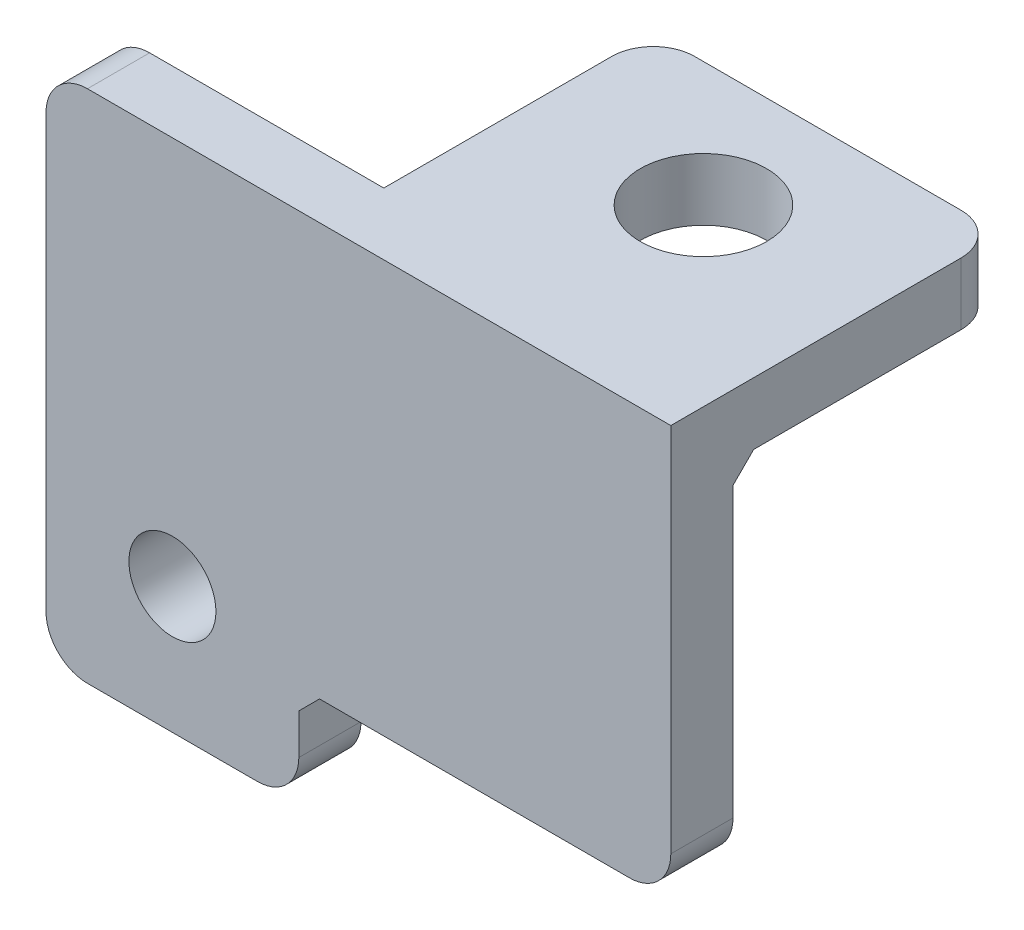
ISO-10303-21;
HEADER;
FILE_DESCRIPTION(('STEP AP214'),'2;1');
FILE_NAME('part.step','',(''),(''),'','','');
FILE_SCHEMA(('AUTOMOTIVE_DESIGN { 1 0 10303 214 1 1 1 1 }'));
ENDSEC;
DATA;
#1=APPLICATION_CONTEXT('core data for automotive mechanical design processes');
#2=APPLICATION_PROTOCOL_DEFINITION('international standard','automotive_design',2000,#1);
#3=PRODUCT_CONTEXT('',#1,'mechanical');
#4=PRODUCT('Part','Part','',(#3));
#5=PRODUCT_RELATED_PRODUCT_CATEGORY('part','',(#4));
#6=PRODUCT_DEFINITION_FORMATION('','',#4);
#7=PRODUCT_DEFINITION_CONTEXT('part definition',#1,'design');
#8=PRODUCT_DEFINITION('design','',#6,#7);
#9=PRODUCT_DEFINITION_SHAPE('','',#8);
#10=(LENGTH_UNIT() NAMED_UNIT(*) SI_UNIT(.MILLI.,.METRE.));
#11=(NAMED_UNIT(*) PLANE_ANGLE_UNIT() SI_UNIT($,.RADIAN.));
#12=(NAMED_UNIT(*) SI_UNIT($,.STERADIAN.) SOLID_ANGLE_UNIT());
#13=UNCERTAINTY_MEASURE_WITH_UNIT(LENGTH_MEASURE(1.E-05),#10,'distance_accuracy_value','');
#14=(GEOMETRIC_REPRESENTATION_CONTEXT(3) GLOBAL_UNCERTAINTY_ASSIGNED_CONTEXT((#13)) GLOBAL_UNIT_ASSIGNED_CONTEXT((#10,
#11,#12)) REPRESENTATION_CONTEXT('',''));
#15=CARTESIAN_POINT('',(0.,0.,0.));
#16=DIRECTION('',(0.,0.,1.));
#17=DIRECTION('',(1.,0.,0.));
#18=AXIS2_PLACEMENT_3D('',#15,#16,#17);
#19=CARTESIAN_POINT('',(0.,0.,0.));
#20=DIRECTION('',(0.,0.,1.));
#21=DIRECTION('',(1.,0.,0.));
#22=AXIS2_PLACEMENT_3D('',#19,#20,#21);
#23=PLANE('',#22);
#24=CARTESIAN_POINT('',(0.900000000000694,59.,0.));
#25=DIRECTION('',(0.,0.,1.));
#26=DIRECTION('',(1.,0.,0.));
#27=AXIS2_PLACEMENT_3D('',#24,#25,#26);
#28=CIRCLE('',#27,2.1);
#29=CARTESIAN_POINT('',(3.00000000000069,59.,0.));
#30=VERTEX_POINT('',#29);
#31=EDGE_CURVE('E248',#30,#30,#28,.T.);
#32=ORIENTED_EDGE('',*,*,#31,.T.);
#33=EDGE_LOOP('',(#32));
#34=FACE_BOUND('',#33,.T.);
#35=DIRECTION('',(0.,-1.,0.));
#36=VECTOR('',#35,1.);
#37=CARTESIAN_POINT('',(-5.19999999999931,77.7499999999997,0.));
#38=LINE('',#37,#36);
#39=CARTESIAN_POINT('',(-5.19999999999931,75.7499999999997,0.));
#40=VERTEX_POINT('',#39);
#41=CARTESIAN_POINT('',(-5.1999999999993,54.9,0.));
#42=VERTEX_POINT('',#41);
#43=EDGE_CURVE('E253',#40,#42,#38,.T.);
#44=ORIENTED_EDGE('',*,*,#43,.F.);
#45=CARTESIAN_POINT('',(-3.19999999999931,75.7499999999997,0.));
#46=DIRECTION('',(0.,0.,1.));
#47=DIRECTION('',(1.,0.,0.));
#48=AXIS2_PLACEMENT_3D('',#45,#46,#47);
#49=CIRCLE('',#48,2.);
#50=CARTESIAN_POINT('',(-3.19999999999931,77.7499999999997,0.));
#51=VERTEX_POINT('',#50);
#52=EDGE_CURVE('E364',#40,#51,#49,.F.);
#53=ORIENTED_EDGE('',*,*,#52,.T.);
#54=DIRECTION('',(-1.,0.,0.));
#55=VECTOR('',#54,1.);
#56=CARTESIAN_POINT('',(-5.19999999999931,77.7499999999997,0.));
#57=LINE('',#56,#55);
#58=CARTESIAN_POINT('',(8.1000000000007,77.7499999999997,0.));
#59=VERTEX_POINT('',#58);
#60=EDGE_CURVE('E262',#59,#51,#57,.T.);
#61=ORIENTED_EDGE('',*,*,#60,.F.);
#62=DIRECTION('',(0.,1.,0.));
#63=VECTOR('',#62,1.);
#64=CARTESIAN_POINT('',(8.1000000000007,0.,0.));
#65=LINE('',#64,#63);
#66=CARTESIAN_POINT('',(8.1000000000007,73.7499999999997,0.));
#67=VERTEX_POINT('',#66);
#68=EDGE_CURVE('E241',#67,#59,#65,.T.);
#69=ORIENTED_EDGE('',*,*,#68,.F.);
#70=DIRECTION('',(1.,0.,0.));
#71=VECTOR('',#70,1.);
#72=CARTESIAN_POINT('',(0.,73.7499999999997,0.));
#73=LINE('',#72,#71);
#74=CARTESIAN_POINT('',(24.9500000000057,73.7499999999997,0.));
#75=VERTEX_POINT('',#74);
#76=EDGE_CURVE('E308',#67,#75,#73,.T.);
#77=ORIENTED_EDGE('',*,*,#76,.T.);
#78=DIRECTION('',(0.,1.,0.));
#79=VECTOR('',#78,1.);
#80=CARTESIAN_POINT('',(24.9500000000057,57.8499999999997,0.));
#81=LINE('',#80,#79);
#82=CARTESIAN_POINT('',(24.9500000000057,59.8499999999997,0.));
#83=VERTEX_POINT('',#82);
#84=EDGE_CURVE('E295',#83,#75,#81,.T.);
#85=ORIENTED_EDGE('',*,*,#84,.F.);
#86=CARTESIAN_POINT('',(22.9500000000057,59.8499999999997,0.));
#87=DIRECTION('',(0.,0.,1.));
#88=DIRECTION('',(1.,0.,0.));
#89=AXIS2_PLACEMENT_3D('',#86,#87,#88);
#90=CIRCLE('',#89,2.);
#91=CARTESIAN_POINT('',(22.9500000000057,57.8499999999997,0.));
#92=VERTEX_POINT('',#91);
#93=EDGE_CURVE('E355',#83,#92,#90,.F.);
#94=ORIENTED_EDGE('',*,*,#93,.T.);
#95=DIRECTION('',(1.,0.,0.));
#96=VECTOR('',#95,1.);
#97=CARTESIAN_POINT('',(7.00000000000069,57.8499999999997,0.));
#98=LINE('',#97,#96);
#99=CARTESIAN_POINT('',(21.9500000000057,57.8499999999997,0.));
#100=VERTEX_POINT('',#99);
#101=EDGE_CURVE('E291',#100,#92,#98,.T.);
#102=ORIENTED_EDGE('',*,*,#101,.F.);
#103=DIRECTION('',(0.,-1.,0.));
#104=VECTOR('',#103,1.);
#105=CARTESIAN_POINT('',(21.9500000000057,57.8499999999997,0.));
#106=LINE('',#105,#104);
#107=CARTESIAN_POINT('',(21.9500000000057,59.8499999999997,0.));
#108=VERTEX_POINT('',#107);
#109=EDGE_CURVE('E221',#108,#100,#106,.T.);
#110=ORIENTED_EDGE('',*,*,#109,.F.);
#111=DIRECTION('',(-1.,0.,0.));
#112=VECTOR('',#111,1.);
#113=CARTESIAN_POINT('',(16.4000000000057,59.8499999999997,0.));
#114=LINE('',#113,#112);
#115=CARTESIAN_POINT('',(16.4000000000057,59.8499999999997,0.));
#116=VERTEX_POINT('',#115);
#117=EDGE_CURVE('E312',#108,#116,#114,.T.);
#118=ORIENTED_EDGE('',*,*,#117,.T.);
#119=DIRECTION('',(0.,1.,0.));
#120=VECTOR('',#119,1.);
#121=CARTESIAN_POINT('',(16.4000000000057,57.8499999999997,0.));
#122=LINE('',#121,#120);
#123=CARTESIAN_POINT('',(16.4000000000057,57.8499999999997,0.));
#124=VERTEX_POINT('',#123);
#125=EDGE_CURVE('E217',#124,#116,#122,.T.);
#126=ORIENTED_EDGE('',*,*,#125,.F.);
#127=CARTESIAN_POINT('',(8.00000000000071,57.8499999999997,0.));
#128=VERTEX_POINT('',#127);
#129=EDGE_CURVE('E292',#128,#124,#98,.T.);
#130=ORIENTED_EDGE('',*,*,#129,.F.);
#131=DIRECTION('',(0.707106781186551,0.707106781186544,0.));
#132=VECTOR('',#131,1.);
#133=CARTESIAN_POINT('',(-24.9249999999995,24.9249999999998,0.));
#134=LINE('',#133,#132);
#135=CARTESIAN_POINT('',(7.00000000000069,56.8499999999997,0.));
#136=VERTEX_POINT('',#135);
#137=EDGE_CURVE('E333',#128,#136,#134,.F.);
#138=ORIENTED_EDGE('',*,*,#137,.T.);
#139=DIRECTION('',(0.,1.,0.));
#140=VECTOR('',#139,1.);
#141=CARTESIAN_POINT('',(7.00000000000069,57.8499999999997,0.));
#142=LINE('',#141,#140);
#143=CARTESIAN_POINT('',(7.00000000000069,54.9,0.));
#144=VERTEX_POINT('',#143);
#145=EDGE_CURVE('E288',#144,#136,#142,.T.);
#146=ORIENTED_EDGE('',*,*,#145,.F.);
#147=CARTESIAN_POINT('',(5.00000000000069,54.9,0.));
#148=DIRECTION('',(0.,0.,1.));
#149=DIRECTION('',(1.,0.,0.));
#150=AXIS2_PLACEMENT_3D('',#147,#148,#149);
#151=CIRCLE('',#150,2.);
#152=CARTESIAN_POINT('',(5.00000000000069,52.9,0.));
#153=VERTEX_POINT('',#152);
#154=EDGE_CURVE('E358',#144,#153,#151,.F.);
#155=ORIENTED_EDGE('',*,*,#154,.T.);
#156=DIRECTION('',(1.,0.,0.));
#157=VECTOR('',#156,1.);
#158=CARTESIAN_POINT('',(-5.1999999999993,52.9,0.));
#159=LINE('',#158,#157);
#160=CARTESIAN_POINT('',(-3.1999999999993,52.9,0.));
#161=VERTEX_POINT('',#160);
#162=EDGE_CURVE('E284',#161,#153,#159,.T.);
#163=ORIENTED_EDGE('',*,*,#162,.F.);
#164=CARTESIAN_POINT('',(-3.1999999999993,54.9,0.));
#165=DIRECTION('',(0.,0.,1.));
#166=DIRECTION('',(1.,0.,0.));
#167=AXIS2_PLACEMENT_3D('',#164,#165,#166);
#168=CIRCLE('',#167,2.);
#169=EDGE_CURVE('E361',#161,#42,#168,.F.);
#170=ORIENTED_EDGE('',*,*,#169,.T.);
#171=EDGE_LOOP('',(#44,#53,#61,#69,#77,#85,#94,#102,#110,#118,#126,#130,#138,#146,#155,#163,#170));
#172=FACE_BOUND('',#171,.T.);
#173=ADVANCED_FACE('F41',(#34,#172),#23,.F.);
#174=CARTESIAN_POINT('',(0.,0.,3.));
#175=DIRECTION('',(0.,0.,1.));
#176=DIRECTION('',(1.,0.,0.));
#177=AXIS2_PLACEMENT_3D('',#174,#175,#176);
#178=PLANE('',#177);
#179=DIRECTION('',(-1.,0.,0.));
#180=VECTOR('',#179,1.);
#181=CARTESIAN_POINT('',(24.9500000000057,77.7499999999997,3.));
#182=LINE('',#181,#180);
#183=CARTESIAN_POINT('',(24.9500000000057,77.7499999999997,3.));
#184=VERTEX_POINT('',#183);
#185=CARTESIAN_POINT('',(-3.19999999999931,77.7499999999997,3.));
#186=VERTEX_POINT('',#185);
#187=EDGE_CURVE('E276',#184,#186,#182,.T.);
#188=ORIENTED_EDGE('',*,*,#187,.T.);
#189=CARTESIAN_POINT('',(-3.19999999999931,75.7499999999997,3.));
#190=DIRECTION('',(0.,0.,1.));
#191=DIRECTION('',(1.,0.,0.));
#192=AXIS2_PLACEMENT_3D('',#189,#190,#191);
#193=CIRCLE('',#192,2.);
#194=CARTESIAN_POINT('',(-5.19999999999931,75.7499999999997,3.));
#195=VERTEX_POINT('',#194);
#196=EDGE_CURVE('E385',#186,#195,#193,.T.);
#197=ORIENTED_EDGE('',*,*,#196,.T.);
#198=DIRECTION('',(0.,-1.,0.));
#199=VECTOR('',#198,1.);
#200=CARTESIAN_POINT('',(-5.19999999999931,77.7499999999997,3.));
#201=LINE('',#200,#199);
#202=CARTESIAN_POINT('',(-5.1999999999993,54.9,3.));
#203=VERTEX_POINT('',#202);
#204=EDGE_CURVE('E257',#195,#203,#201,.T.);
#205=ORIENTED_EDGE('',*,*,#204,.T.);
#206=CARTESIAN_POINT('',(-3.1999999999993,54.9,3.));
#207=DIRECTION('',(0.,0.,1.));
#208=DIRECTION('',(1.,0.,0.));
#209=AXIS2_PLACEMENT_3D('',#206,#207,#208);
#210=CIRCLE('',#209,2.);
#211=CARTESIAN_POINT('',(-3.1999999999993,52.9,3.));
#212=VERTEX_POINT('',#211);
#213=EDGE_CURVE('E382',#203,#212,#210,.T.);
#214=ORIENTED_EDGE('',*,*,#213,.T.);
#215=DIRECTION('',(1.,0.,0.));
#216=VECTOR('',#215,1.);
#217=CARTESIAN_POINT('',(-5.1999999999993,52.9,3.));
#218=LINE('',#217,#216);
#219=CARTESIAN_POINT('',(5.00000000000069,52.9,3.));
#220=VERTEX_POINT('',#219);
#221=EDGE_CURVE('E261',#212,#220,#218,.T.);
#222=ORIENTED_EDGE('',*,*,#221,.T.);
#223=CARTESIAN_POINT('',(5.00000000000069,54.9,3.));
#224=DIRECTION('',(0.,0.,1.));
#225=DIRECTION('',(1.,0.,0.));
#226=AXIS2_PLACEMENT_3D('',#223,#224,#225);
#227=CIRCLE('',#226,2.);
#228=CARTESIAN_POINT('',(7.00000000000069,54.9,3.));
#229=VERTEX_POINT('',#228);
#230=EDGE_CURVE('E379',#220,#229,#227,.T.);
#231=ORIENTED_EDGE('',*,*,#230,.T.);
#232=DIRECTION('',(0.,1.,0.));
#233=VECTOR('',#232,1.);
#234=CARTESIAN_POINT('',(7.00000000000069,57.8499999999997,3.));
#235=LINE('',#234,#233);
#236=CARTESIAN_POINT('',(7.00000000000069,56.8499999999997,3.));
#237=VERTEX_POINT('',#236);
#238=EDGE_CURVE('E266',#229,#237,#235,.T.);
#239=ORIENTED_EDGE('',*,*,#238,.T.);
#240=DIRECTION('',(-0.707106781186551,-0.707106781186544,0.));
#241=VECTOR('',#240,1.);
#242=CARTESIAN_POINT('',(8.00000000000071,57.8499999999997,3.));
#243=LINE('',#242,#241);
#244=CARTESIAN_POINT('',(8.00000000000071,57.8499999999997,3.));
#245=VERTEX_POINT('',#244);
#246=EDGE_CURVE('E337',#237,#245,#243,.F.);
#247=ORIENTED_EDGE('',*,*,#246,.T.);
#248=DIRECTION('',(1.,0.,0.));
#249=VECTOR('',#248,1.);
#250=CARTESIAN_POINT('',(7.00000000000069,57.8499999999997,3.));
#251=LINE('',#250,#249);
#252=CARTESIAN_POINT('',(22.9500000000057,57.8499999999997,3.));
#253=VERTEX_POINT('',#252);
#254=EDGE_CURVE('E269',#245,#253,#251,.T.);
#255=ORIENTED_EDGE('',*,*,#254,.T.);
#256=CARTESIAN_POINT('',(22.9500000000057,59.8499999999997,3.));
#257=DIRECTION('',(0.,0.,1.));
#258=DIRECTION('',(1.,0.,0.));
#259=AXIS2_PLACEMENT_3D('',#256,#257,#258);
#260=CIRCLE('',#259,2.);
#261=CARTESIAN_POINT('',(24.9500000000057,59.8499999999997,3.));
#262=VERTEX_POINT('',#261);
#263=EDGE_CURVE('E376',#253,#262,#260,.T.);
#264=ORIENTED_EDGE('',*,*,#263,.T.);
#265=DIRECTION('',(0.,1.,0.));
#266=VECTOR('',#265,1.);
#267=CARTESIAN_POINT('',(24.9500000000057,57.8499999999997,3.));
#268=LINE('',#267,#266);
#269=EDGE_CURVE('E273',#262,#184,#268,.T.);
#270=ORIENTED_EDGE('',*,*,#269,.T.);
#271=EDGE_LOOP('',(#188,#197,#205,#214,#222,#231,#239,#247,#255,#264,#270));
#272=FACE_BOUND('',#271,.T.);
#273=CARTESIAN_POINT('',(0.900000000000694,59.,3.));
#274=DIRECTION('',(0.,0.,1.));
#275=DIRECTION('',(1.,0.,0.));
#276=AXIS2_PLACEMENT_3D('',#273,#274,#275);
#277=CIRCLE('',#276,2.1);
#278=CARTESIAN_POINT('',(3.00000000000069,59.,3.));
#279=VERTEX_POINT('',#278);
#280=EDGE_CURVE('E249',#279,#279,#277,.T.);
#281=ORIENTED_EDGE('',*,*,#280,.F.);
#282=EDGE_LOOP('',(#281));
#283=FACE_BOUND('',#282,.T.);
#284=ADVANCED_FACE('F452',(#272,#283),#178,.T.);
#285=CARTESIAN_POINT('',(-5.19999999999931,77.7499999999997,3.));
#286=DIRECTION('',(1.,0.,0.));
#287=DIRECTION('',(0.,1.,0.));
#288=AXIS2_PLACEMENT_3D('',#285,#286,#287);
#289=PLANE('',#288);
#290=ORIENTED_EDGE('',*,*,#204,.F.);
#291=DIRECTION('',(0.,0.,-1.));
#292=VECTOR('',#291,1.);
#293=CARTESIAN_POINT('',(-5.19999999999931,75.7499999999997,3.));
#294=LINE('',#293,#292);
#295=EDGE_CURVE('E351',#195,#40,#294,.T.);
#296=ORIENTED_EDGE('',*,*,#295,.T.);
#297=ORIENTED_EDGE('',*,*,#43,.T.);
#298=DIRECTION('',(0.,0.,-1.));
#299=VECTOR('',#298,1.);
#300=CARTESIAN_POINT('',(-5.1999999999993,54.9,3.));
#301=LINE('',#300,#299);
#302=EDGE_CURVE('E348',#42,#203,#301,.F.);
#303=ORIENTED_EDGE('',*,*,#302,.T.);
#304=EDGE_LOOP('',(#290,#296,#297,#303));
#305=FACE_BOUND('',#304,.T.);
#306=ADVANCED_FACE('F456',(#305),#289,.F.);
#307=CARTESIAN_POINT('',(-5.1999999999993,52.9,3.));
#308=DIRECTION('',(0.,1.,0.));
#309=DIRECTION('',(0.,0.,1.));
#310=AXIS2_PLACEMENT_3D('',#307,#308,#309);
#311=PLANE('',#310);
#312=ORIENTED_EDGE('',*,*,#221,.F.);
#313=DIRECTION('',(0.,0.,-1.));
#314=VECTOR('',#313,1.);
#315=CARTESIAN_POINT('',(-3.1999999999993,52.9,3.));
#316=LINE('',#315,#314);
#317=EDGE_CURVE('E391',#212,#161,#316,.T.);
#318=ORIENTED_EDGE('',*,*,#317,.T.);
#319=ORIENTED_EDGE('',*,*,#162,.T.);
#320=DIRECTION('',(0.,0.,-1.));
#321=VECTOR('',#320,1.);
#322=CARTESIAN_POINT('',(5.00000000000069,52.9,3.));
#323=LINE('',#322,#321);
#324=EDGE_CURVE('E388',#153,#220,#323,.F.);
#325=ORIENTED_EDGE('',*,*,#324,.T.);
#326=EDGE_LOOP('',(#312,#318,#319,#325));
#327=FACE_BOUND('',#326,.T.);
#328=ADVANCED_FACE('F464',(#327),#311,.F.);
#329=CARTESIAN_POINT('',(7.00000000000069,57.8499999999997,3.));
#330=DIRECTION('',(-1.,0.,0.));
#331=DIRECTION('',(0.,-1.,0.));
#332=AXIS2_PLACEMENT_3D('',#329,#330,#331);
#333=PLANE('',#332);
#334=ORIENTED_EDGE('',*,*,#238,.F.);
#335=DIRECTION('',(0.,0.,-1.));
#336=VECTOR('',#335,1.);
#337=CARTESIAN_POINT('',(7.00000000000069,54.9,3.));
#338=LINE('',#337,#336);
#339=EDGE_CURVE('E395',#229,#144,#338,.T.);
#340=ORIENTED_EDGE('',*,*,#339,.T.);
#341=ORIENTED_EDGE('',*,*,#145,.T.);
#342=DIRECTION('',(0.,0.,1.));
#343=VECTOR('',#342,1.);
#344=CARTESIAN_POINT('',(7.00000000000069,56.8499999999997,3.));
#345=LINE('',#344,#343);
#346=EDGE_CURVE('E320',#136,#237,#345,.T.);
#347=ORIENTED_EDGE('',*,*,#346,.T.);
#348=EDGE_LOOP('',(#334,#340,#341,#347));
#349=FACE_BOUND('',#348,.T.);
#350=ADVANCED_FACE('F472',(#349),#333,.F.);
#351=CARTESIAN_POINT('',(7.00000000000069,57.8499999999997,3.));
#352=DIRECTION('',(0.,1.,0.));
#353=DIRECTION('',(0.,0.,1.));
#354=AXIS2_PLACEMENT_3D('',#351,#352,#353);
#355=PLANE('',#354);
#356=ORIENTED_EDGE('',*,*,#101,.T.);
#357=DIRECTION('',(0.,0.,-1.));
#358=VECTOR('',#357,1.);
#359=CARTESIAN_POINT('',(22.9500000000057,57.8499999999997,3.));
#360=LINE('',#359,#358);
#361=EDGE_CURVE('E407',#92,#253,#360,.F.);
#362=ORIENTED_EDGE('',*,*,#361,.T.);
#363=ORIENTED_EDGE('',*,*,#254,.F.);
#364=DIRECTION('',(0.,0.,-1.));
#365=VECTOR('',#364,1.);
#366=CARTESIAN_POINT('',(8.00000000000071,57.8499999999997,0.));
#367=LINE('',#366,#365);
#368=EDGE_CURVE('E316',#245,#128,#367,.T.);
#369=ORIENTED_EDGE('',*,*,#368,.T.);
#370=ORIENTED_EDGE('',*,*,#129,.T.);
#371=DIRECTION('',(0.,0.,1.));
#372=VECTOR('',#371,1.);
#373=CARTESIAN_POINT('',(16.4000000000057,57.8499999999997,-3.));
#374=LINE('',#373,#372);
#375=CARTESIAN_POINT('',(16.4000000000057,57.8499999999997,-3.));
#376=VERTEX_POINT('',#375);
#377=EDGE_CURVE('E202',#376,#124,#374,.T.);
#378=ORIENTED_EDGE('',*,*,#377,.F.);
#379=DIRECTION('',(-1.,0.,0.));
#380=VECTOR('',#379,1.);
#381=CARTESIAN_POINT('',(21.9500000000057,57.8499999999997,-3.));
#382=LINE('',#381,#380);
#383=CARTESIAN_POINT('',(21.9500000000057,57.8499999999997,-3.));
#384=VERTEX_POINT('',#383);
#385=EDGE_CURVE('E194',#384,#376,#382,.T.);
#386=ORIENTED_EDGE('',*,*,#385,.F.);
#387=DIRECTION('',(0.,0.,1.));
#388=VECTOR('',#387,1.);
#389=CARTESIAN_POINT('',(21.9500000000057,57.8499999999997,-3.));
#390=LINE('',#389,#388);
#391=EDGE_CURVE('E199',#384,#100,#390,.T.);
#392=ORIENTED_EDGE('',*,*,#391,.T.);
#393=EDGE_LOOP('',(#356,#362,#363,#369,#370,#378,#386,#392));
#394=FACE_BOUND('',#393,.T.);
#395=ADVANCED_FACE('F197',(#394),#355,.F.);
#396=CARTESIAN_POINT('',(24.9500000000057,57.8499999999997,3.));
#397=DIRECTION('',(-1.,0.,0.));
#398=DIRECTION('',(0.,0.,1.));
#399=AXIS2_PLACEMENT_3D('',#396,#397,#398);
#400=PLANE('',#399);
#401=ORIENTED_EDGE('',*,*,#269,.F.);
#402=DIRECTION('',(0.,0.,-1.));
#403=VECTOR('',#402,1.);
#404=CARTESIAN_POINT('',(24.9500000000057,59.8499999999997,3.));
#405=LINE('',#404,#403);
#406=EDGE_CURVE('E403',#262,#83,#405,.T.);
#407=ORIENTED_EDGE('',*,*,#406,.T.);
#408=ORIENTED_EDGE('',*,*,#84,.T.);
#409=DIRECTION('',(0.,0.707106781186551,-0.707106781186544));
#410=VECTOR('',#409,1.);
#411=CARTESIAN_POINT('',(24.9500000000057,64.2999999999996,9.44999999999997));
#412=LINE('',#411,#410);
#413=CARTESIAN_POINT('',(24.9500000000057,74.7499999999997,-1.));
#414=VERTEX_POINT('',#413);
#415=EDGE_CURVE('E340',#75,#414,#412,.T.);
#416=ORIENTED_EDGE('',*,*,#415,.T.);
#417=DIRECTION('',(0.,0.,1.));
#418=VECTOR('',#417,1.);
#419=CARTESIAN_POINT('',(24.9500000000057,74.7499999999997,3.));
#420=LINE('',#419,#418);
#421=CARTESIAN_POINT('',(24.9500000000057,74.7499999999997,-11.0000000000003));
#422=VERTEX_POINT('',#421);
#423=EDGE_CURVE('E239',#422,#414,#420,.T.);
#424=ORIENTED_EDGE('',*,*,#423,.F.);
#425=DIRECTION('',(0.,1.,0.));
#426=VECTOR('',#425,1.);
#427=CARTESIAN_POINT('',(24.9500000000057,57.8499999999997,-11.0000000000003));
#428=LINE('',#427,#426);
#429=CARTESIAN_POINT('',(24.9500000000057,77.7499999999997,-11.0000000000003));
#430=VERTEX_POINT('',#429);
#431=EDGE_CURVE('E399',#422,#430,#428,.T.);
#432=ORIENTED_EDGE('',*,*,#431,.T.);
#433=DIRECTION('',(0.,0.,-1.));
#434=VECTOR('',#433,1.);
#435=CARTESIAN_POINT('',(24.9500000000057,77.7499999999997,3.));
#436=LINE('',#435,#434);
#437=EDGE_CURVE('E280',#184,#430,#436,.T.);
#438=ORIENTED_EDGE('',*,*,#437,.F.);
#439=EDGE_LOOP('',(#401,#407,#408,#416,#424,#432,#438));
#440=FACE_BOUND('',#439,.T.);
#441=ADVANCED_FACE('F426',(#440),#400,.F.);
#442=CARTESIAN_POINT('',(-5.19999999999931,77.7499999999997,3.));
#443=DIRECTION('',(0.,-1.,0.));
#444=DIRECTION('',(0.,0.,-1.));
#445=AXIS2_PLACEMENT_3D('',#442,#443,#444);
#446=PLANE('',#445);
#447=CARTESIAN_POINT('',(16.5250000000032,77.7499999999997,-7.00000000000016));
#448=DIRECTION('',(0.,-1.,0.));
#449=DIRECTION('',(1.,0.,0.));
#450=AXIS2_PLACEMENT_3D('',#447,#448,#449);
#451=CIRCLE('',#450,3.05);
#452=CARTESIAN_POINT('',(19.5750000000032,77.7499999999997,-7.00000000000016));
#453=VERTEX_POINT('',#452);
#454=EDGE_CURVE('E558',#453,#453,#451,.T.);
#455=ORIENTED_EDGE('',*,*,#454,.T.);
#456=EDGE_LOOP('',(#455));
#457=FACE_BOUND('',#456,.T.);
#458=ORIENTED_EDGE('',*,*,#60,.T.);
#459=DIRECTION('',(0.,0.,-1.));
#460=VECTOR('',#459,1.);
#461=CARTESIAN_POINT('',(-3.19999999999931,77.7499999999997,3.));
#462=LINE('',#461,#460);
#463=EDGE_CURVE('E373',#51,#186,#462,.F.);
#464=ORIENTED_EDGE('',*,*,#463,.T.);
#465=ORIENTED_EDGE('',*,*,#187,.F.);
#466=ORIENTED_EDGE('',*,*,#437,.T.);
#467=CARTESIAN_POINT('',(22.9500000000057,77.7499999999997,-11.0000000000003));
#468=DIRECTION('',(0.,-1.,0.));
#469=DIRECTION('',(0.,0.,-1.));
#470=AXIS2_PLACEMENT_3D('',#467,#468,#469);
#471=CIRCLE('',#470,2.);
#472=CARTESIAN_POINT('',(22.9500000000057,77.7499999999997,-13.0000000000003));
#473=VERTEX_POINT('',#472);
#474=EDGE_CURVE('E367',#430,#473,#471,.F.);
#475=ORIENTED_EDGE('',*,*,#474,.T.);
#476=DIRECTION('',(1.,0.,0.));
#477=VECTOR('',#476,1.);
#478=CARTESIAN_POINT('',(24.9500000000057,77.7499999999997,-13.0000000000003));
#479=LINE('',#478,#477);
#480=CARTESIAN_POINT('',(10.1000000000007,77.7499999999997,-13.0000000000003));
#481=VERTEX_POINT('',#480);
#482=EDGE_CURVE('E227',#481,#473,#479,.T.);
#483=ORIENTED_EDGE('',*,*,#482,.F.);
#484=CARTESIAN_POINT('',(10.1000000000007,77.7499999999997,-11.0000000000003));
#485=DIRECTION('',(0.,-1.,0.));
#486=DIRECTION('',(0.,0.,-1.));
#487=AXIS2_PLACEMENT_3D('',#484,#485,#486);
#488=CIRCLE('',#487,2.);
#489=CARTESIAN_POINT('',(8.1000000000007,77.7499999999997,-11.0000000000003));
#490=VERTEX_POINT('',#489);
#491=EDGE_CURVE('E370',#481,#490,#488,.F.);
#492=ORIENTED_EDGE('',*,*,#491,.T.);
#493=DIRECTION('',(0.,0.,-1.));
#494=VECTOR('',#493,1.);
#495=CARTESIAN_POINT('',(8.1000000000007,77.7499999999997,3.));
#496=LINE('',#495,#494);
#497=EDGE_CURVE('E223',#59,#490,#496,.T.);
#498=ORIENTED_EDGE('',*,*,#497,.F.);
#499=EDGE_LOOP('',(#458,#464,#465,#466,#475,#483,#492,#498));
#500=FACE_BOUND('',#499,.T.);
#501=ADVANCED_FACE('F432',(#457,#500),#446,.F.);
#502=CARTESIAN_POINT('',(0.900000000000694,59.,3.));
#503=DIRECTION('',(0.,0.,-1.));
#504=DIRECTION('',(-1.,0.,0.));
#505=AXIS2_PLACEMENT_3D('',#502,#503,#504);
#506=CYLINDRICAL_SURFACE('',#505,2.1);
#507=ORIENTED_EDGE('',*,*,#280,.T.);
#508=EDGE_LOOP('',(#507));
#509=FACE_BOUND('',#508,.T.);
#510=ORIENTED_EDGE('',*,*,#31,.F.);
#511=EDGE_LOOP('',(#510));
#512=FACE_BOUND('',#511,.T.);
#513=ADVANCED_FACE('F513',(#509,#512),#506,.F.);
#514=CARTESIAN_POINT('',(0.,74.7499999999997,0.));
#515=DIRECTION('',(0.,-1.,0.));
#516=DIRECTION('',(0.,0.,-1.));
#517=AXIS2_PLACEMENT_3D('',#514,#515,#516);
#518=PLANE('',#517);
#519=CARTESIAN_POINT('',(16.5250000000032,74.7499999999997,-7.00000000000016));
#520=DIRECTION('',(0.,-1.,0.));
#521=DIRECTION('',(1.,0.,0.));
#522=AXIS2_PLACEMENT_3D('',#519,#520,#521);
#523=CIRCLE('',#522,3.05);
#524=CARTESIAN_POINT('',(19.5750000000032,74.7499999999997,-7.00000000000016));
#525=VERTEX_POINT('',#524);
#526=EDGE_CURVE('E563',#525,#525,#523,.T.);
#527=ORIENTED_EDGE('',*,*,#526,.F.);
#528=EDGE_LOOP('',(#527));
#529=FACE_BOUND('',#528,.T.);
#530=DIRECTION('',(0.,0.,-1.));
#531=VECTOR('',#530,1.);
#532=CARTESIAN_POINT('',(8.1000000000007,74.7499999999997,3.));
#533=LINE('',#532,#531);
#534=CARTESIAN_POINT('',(8.1000000000007,74.7499999999997,-1.));
#535=VERTEX_POINT('',#534);
#536=CARTESIAN_POINT('',(8.1000000000007,74.7499999999997,-11.0000000000003));
#537=VERTEX_POINT('',#536);
#538=EDGE_CURVE('E233',#535,#537,#533,.T.);
#539=ORIENTED_EDGE('',*,*,#538,.T.);
#540=CARTESIAN_POINT('',(10.1000000000007,74.7499999999997,-11.0000000000003));
#541=DIRECTION('',(0.,-1.,0.));
#542=DIRECTION('',(0.,0.,-1.));
#543=AXIS2_PLACEMENT_3D('',#540,#541,#542);
#544=CIRCLE('',#543,2.);
#545=CARTESIAN_POINT('',(10.1000000000007,74.7499999999997,-13.0000000000003));
#546=VERTEX_POINT('',#545);
#547=EDGE_CURVE('E11',#537,#546,#544,.T.);
#548=ORIENTED_EDGE('',*,*,#547,.T.);
#549=DIRECTION('',(1.,0.,0.));
#550=VECTOR('',#549,1.);
#551=CARTESIAN_POINT('',(24.9500000000057,74.7499999999997,-13.0000000000003));
#552=LINE('',#551,#550);
#553=CARTESIAN_POINT('',(22.9500000000057,74.7499999999997,-13.0000000000003));
#554=VERTEX_POINT('',#553);
#555=EDGE_CURVE('E236',#546,#554,#552,.T.);
#556=ORIENTED_EDGE('',*,*,#555,.T.);
#557=CARTESIAN_POINT('',(22.9500000000057,74.7499999999997,-11.0000000000003));
#558=DIRECTION('',(0.,-1.,0.));
#559=DIRECTION('',(0.,0.,-1.));
#560=AXIS2_PLACEMENT_3D('',#557,#558,#559);
#561=CIRCLE('',#560,2.);
#562=EDGE_CURVE('E50',#554,#422,#561,.T.);
#563=ORIENTED_EDGE('',*,*,#562,.T.);
#564=ORIENTED_EDGE('',*,*,#423,.T.);
#565=DIRECTION('',(-1.,0.,0.));
#566=VECTOR('',#565,1.);
#567=CARTESIAN_POINT('',(0.,74.7499999999997,-1.));
#568=LINE('',#567,#566);
#569=EDGE_CURVE('E324',#414,#535,#568,.T.);
#570=ORIENTED_EDGE('',*,*,#569,.T.);
#571=EDGE_LOOP('',(#539,#548,#556,#563,#564,#570));
#572=FACE_BOUND('',#571,.T.);
#573=ADVANCED_FACE('F421',(#529,#572),#518,.T.);
#574=CARTESIAN_POINT('',(8.1000000000007,74.7499999999997,3.));
#575=DIRECTION('',(1.,0.,0.));
#576=DIRECTION('',(0.,0.,-1.));
#577=AXIS2_PLACEMENT_3D('',#574,#575,#576);
#578=PLANE('',#577);
#579=ORIENTED_EDGE('',*,*,#497,.T.);
#580=DIRECTION('',(0.,1.,0.));
#581=VECTOR('',#580,1.);
#582=CARTESIAN_POINT('',(8.1000000000007,74.7499999999997,-11.0000000000003));
#583=LINE('',#582,#581);
#584=EDGE_CURVE('E57',#490,#537,#583,.F.);
#585=ORIENTED_EDGE('',*,*,#584,.T.);
#586=ORIENTED_EDGE('',*,*,#538,.F.);
#587=DIRECTION('',(0.,-0.707106781186551,0.707106781186544));
#588=VECTOR('',#587,1.);
#589=CARTESIAN_POINT('',(8.1000000000007,72.7499999999997,0.999999999999977));
#590=LINE('',#589,#588);
#591=EDGE_CURVE('E344',#535,#67,#590,.T.);
#592=ORIENTED_EDGE('',*,*,#591,.T.);
#593=ORIENTED_EDGE('',*,*,#68,.T.);
#594=EDGE_LOOP('',(#579,#585,#586,#592,#593));
#595=FACE_BOUND('',#594,.T.);
#596=ADVANCED_FACE('F439',(#595),#578,.F.);
#597=CARTESIAN_POINT('',(24.9500000000057,74.7499999999997,-13.0000000000003));
#598=DIRECTION('',(0.,0.,1.));
#599=DIRECTION('',(1.,0.,0.));
#600=AXIS2_PLACEMENT_3D('',#597,#598,#599);
#601=PLANE('',#600);
#602=ORIENTED_EDGE('',*,*,#555,.F.);
#603=DIRECTION('',(0.,1.,0.));
#604=VECTOR('',#603,1.);
#605=CARTESIAN_POINT('',(10.1000000000007,74.7499999999997,-13.0000000000003));
#606=LINE('',#605,#604);
#607=EDGE_CURVE('E412',#546,#481,#606,.T.);
#608=ORIENTED_EDGE('',*,*,#607,.T.);
#609=ORIENTED_EDGE('',*,*,#482,.T.);
#610=DIRECTION('',(0.,1.,0.));
#611=VECTOR('',#610,1.);
#612=CARTESIAN_POINT('',(22.9500000000057,74.7499999999997,-13.0000000000003));
#613=LINE('',#612,#611);
#614=EDGE_CURVE('E65',#473,#554,#613,.F.);
#615=ORIENTED_EDGE('',*,*,#614,.T.);
#616=EDGE_LOOP('',(#602,#608,#609,#615));
#617=FACE_BOUND('',#616,.T.);
#618=ADVANCED_FACE('F434',(#617),#601,.F.);
#619=CARTESIAN_POINT('',(21.9500000000057,57.8499999999997,-3.));
#620=DIRECTION('',(-1.,0.,0.));
#621=DIRECTION('',(0.,0.,1.));
#622=AXIS2_PLACEMENT_3D('',#619,#620,#621);
#623=PLANE('',#622);
#624=ORIENTED_EDGE('',*,*,#109,.T.);
#625=ORIENTED_EDGE('',*,*,#391,.F.);
#626=DIRECTION('',(0.,-1.,0.));
#627=VECTOR('',#626,1.);
#628=CARTESIAN_POINT('',(21.9500000000057,57.8499999999997,-3.));
#629=LINE('',#628,#627);
#630=CARTESIAN_POINT('',(21.9500000000057,58.8499999999997,-3.));
#631=VERTEX_POINT('',#630);
#632=EDGE_CURVE('E207',#631,#384,#629,.T.);
#633=ORIENTED_EDGE('',*,*,#632,.F.);
#634=DIRECTION('',(0.,0.,1.));
#635=VECTOR('',#634,1.);
#636=CARTESIAN_POINT('',(21.9500000000057,58.8499999999997,-3.));
#637=LINE('',#636,#635);
#638=CARTESIAN_POINT('',(21.9500000000057,58.8499999999997,-1.00000000000001));
#639=VERTEX_POINT('',#638);
#640=EDGE_CURVE('E550',#631,#639,#637,.T.);
#641=ORIENTED_EDGE('',*,*,#640,.T.);
#642=DIRECTION('',(0.,-0.707106781186543,-0.707106781186552));
#643=VECTOR('',#642,1.);
#644=CARTESIAN_POINT('',(21.9500000000057,57.3499999999997,-2.50000000000002));
#645=LINE('',#644,#643);
#646=EDGE_CURVE('E327',#639,#108,#645,.F.);
#647=ORIENTED_EDGE('',*,*,#646,.T.);
#648=EDGE_LOOP('',(#624,#625,#633,#641,#647));
#649=FACE_BOUND('',#648,.T.);
#650=ADVANCED_FACE('F219',(#649),#623,.F.);
#651=CARTESIAN_POINT('',(16.4000000000057,57.8499999999997,-3.));
#652=DIRECTION('',(1.,0.,0.));
#653=DIRECTION('',(0.,0.,-1.));
#654=AXIS2_PLACEMENT_3D('',#651,#652,#653);
#655=PLANE('',#654);
#656=ORIENTED_EDGE('',*,*,#125,.T.);
#657=DIRECTION('',(0.,0.707106781186543,0.707106781186552));
#658=VECTOR('',#657,1.);
#659=CARTESIAN_POINT('',(16.4000000000057,57.3499999999997,-2.50000000000002));
#660=LINE('',#659,#658);
#661=CARTESIAN_POINT('',(16.4000000000057,58.8499999999997,-1.00000000000001));
#662=VERTEX_POINT('',#661);
#663=EDGE_CURVE('E330',#116,#662,#660,.F.);
#664=ORIENTED_EDGE('',*,*,#663,.T.);
#665=DIRECTION('',(0.,0.,1.));
#666=VECTOR('',#665,1.);
#667=CARTESIAN_POINT('',(16.4000000000057,58.8499999999997,-3.));
#668=LINE('',#667,#666);
#669=CARTESIAN_POINT('',(16.4000000000057,58.8499999999997,-3.));
#670=VERTEX_POINT('',#669);
#671=EDGE_CURVE('E229',#670,#662,#668,.T.);
#672=ORIENTED_EDGE('',*,*,#671,.F.);
#673=DIRECTION('',(0.,1.,0.));
#674=VECTOR('',#673,1.);
#675=CARTESIAN_POINT('',(16.4000000000057,57.8499999999997,-3.));
#676=LINE('',#675,#674);
#677=EDGE_CURVE('E206',#376,#670,#676,.T.);
#678=ORIENTED_EDGE('',*,*,#677,.F.);
#679=ORIENTED_EDGE('',*,*,#377,.T.);
#680=EDGE_LOOP('',(#656,#664,#672,#678,#679));
#681=FACE_BOUND('',#680,.T.);
#682=ADVANCED_FACE('F546',(#681),#655,.F.);
#683=CARTESIAN_POINT('',(21.9500000000057,58.8499999999997,-3.));
#684=DIRECTION('',(0.,-1.,0.));
#685=DIRECTION('',(0.,0.,-1.));
#686=AXIS2_PLACEMENT_3D('',#683,#684,#685);
#687=PLANE('',#686);
#688=ORIENTED_EDGE('',*,*,#671,.T.);
#689=DIRECTION('',(1.,0.,0.));
#690=VECTOR('',#689,1.);
#691=CARTESIAN_POINT('',(21.9500000000057,58.8499999999997,-1.00000000000001));
#692=LINE('',#691,#690);
#693=EDGE_CURVE('E304',#662,#639,#692,.T.);
#694=ORIENTED_EDGE('',*,*,#693,.T.);
#695=ORIENTED_EDGE('',*,*,#640,.F.);
#696=DIRECTION('',(1.,0.,0.));
#697=VECTOR('',#696,1.);
#698=CARTESIAN_POINT('',(21.9500000000057,58.8499999999997,-3.));
#699=LINE('',#698,#697);
#700=EDGE_CURVE('E212',#670,#631,#699,.T.);
#701=ORIENTED_EDGE('',*,*,#700,.F.);
#702=EDGE_LOOP('',(#688,#694,#695,#701));
#703=FACE_BOUND('',#702,.T.);
#704=ADVANCED_FACE('F538',(#703),#687,.F.);
#705=CARTESIAN_POINT('',(0.,0.,-3.));
#706=DIRECTION('',(0.,0.,1.));
#707=DIRECTION('',(1.,0.,0.));
#708=AXIS2_PLACEMENT_3D('',#705,#706,#707);
#709=PLANE('',#708);
#710=ORIENTED_EDGE('',*,*,#632,.T.);
#711=ORIENTED_EDGE('',*,*,#385,.T.);
#712=ORIENTED_EDGE('',*,*,#677,.T.);
#713=ORIENTED_EDGE('',*,*,#700,.T.);
#714=EDGE_LOOP('',(#710,#711,#712,#713));
#715=FACE_BOUND('',#714,.T.);
#716=ADVANCED_FACE('F210',(#715),#709,.F.);
#717=CARTESIAN_POINT('',(21.9500000000057,58.8499999999997,-1.00000000000001));
#718=DIRECTION('',(0.,0.707106781186552,-0.707106781186542));
#719=DIRECTION('',(-1.,0.,0.));
#720=AXIS2_PLACEMENT_3D('',#717,#718,#719);
#721=PLANE('',#720);
#722=ORIENTED_EDGE('',*,*,#663,.F.);
#723=ORIENTED_EDGE('',*,*,#117,.F.);
#724=ORIENTED_EDGE('',*,*,#646,.F.);
#725=ORIENTED_EDGE('',*,*,#693,.F.);
#726=EDGE_LOOP('',(#722,#723,#724,#725));
#727=FACE_BOUND('',#726,.T.);
#728=ADVANCED_FACE('F498',(#727),#721,.T.);
#729=CARTESIAN_POINT('',(8.00000000000071,57.8499999999997,3.));
#730=DIRECTION('',(0.707106781186544,-0.707106781186551,0.));
#731=DIRECTION('',(0.,0.,1.));
#732=AXIS2_PLACEMENT_3D('',#729,#730,#731);
#733=PLANE('',#732);
#734=ORIENTED_EDGE('',*,*,#246,.F.);
#735=ORIENTED_EDGE('',*,*,#346,.F.);
#736=ORIENTED_EDGE('',*,*,#137,.F.);
#737=ORIENTED_EDGE('',*,*,#368,.F.);
#738=EDGE_LOOP('',(#734,#735,#736,#737));
#739=FACE_BOUND('',#738,.T.);
#740=ADVANCED_FACE('F478',(#739),#733,.T.);
#741=CARTESIAN_POINT('',(0.,73.7499999999997,0.));
#742=DIRECTION('',(0.,0.707106781186544,0.707106781186551));
#743=DIRECTION('',(1.,0.,0.));
#744=AXIS2_PLACEMENT_3D('',#741,#742,#743);
#745=PLANE('',#744);
#746=ORIENTED_EDGE('',*,*,#591,.F.);
#747=ORIENTED_EDGE('',*,*,#569,.F.);
#748=ORIENTED_EDGE('',*,*,#415,.F.);
#749=ORIENTED_EDGE('',*,*,#76,.F.);
#750=EDGE_LOOP('',(#746,#747,#748,#749));
#751=FACE_BOUND('',#750,.T.);
#752=ADVANCED_FACE('F488',(#751),#745,.F.);
#753=CARTESIAN_POINT('',(16.5250000000032,77.7499999999997,-7.00000000000016));
#754=DIRECTION('',(0.,-1.,0.));
#755=DIRECTION('',(1.,0.,0.));
#756=AXIS2_PLACEMENT_3D('',#753,#754,#755);
#757=CYLINDRICAL_SURFACE('',#756,3.05);
#758=ORIENTED_EDGE('',*,*,#454,.F.);
#759=EDGE_LOOP('',(#758));
#760=FACE_BOUND('',#759,.T.);
#761=ORIENTED_EDGE('',*,*,#526,.T.);
#762=EDGE_LOOP('',(#761));
#763=FACE_BOUND('',#762,.T.);
#764=ADVANCED_FACE('F490',(#760,#763),#757,.F.);
#765=CARTESIAN_POINT('',(-3.19999999999931,75.7499999999997,3.));
#766=DIRECTION('',(0.,0.,-1.));
#767=DIRECTION('',(-1.,0.,0.));
#768=AXIS2_PLACEMENT_3D('',#765,#766,#767);
#769=CYLINDRICAL_SURFACE('',#768,2.);
#770=ORIENTED_EDGE('',*,*,#196,.F.);
#771=ORIENTED_EDGE('',*,*,#463,.F.);
#772=ORIENTED_EDGE('',*,*,#52,.F.);
#773=ORIENTED_EDGE('',*,*,#295,.F.);
#774=EDGE_LOOP('',(#770,#771,#772,#773));
#775=FACE_BOUND('',#774,.T.);
#776=ADVANCED_FACE('F448',(#775),#769,.T.);
#777=CARTESIAN_POINT('',(-3.1999999999993,54.9,3.));
#778=DIRECTION('',(0.,0.,-1.));
#779=DIRECTION('',(-1.,0.,0.));
#780=AXIS2_PLACEMENT_3D('',#777,#778,#779);
#781=CYLINDRICAL_SURFACE('',#780,2.);
#782=ORIENTED_EDGE('',*,*,#213,.F.);
#783=ORIENTED_EDGE('',*,*,#302,.F.);
#784=ORIENTED_EDGE('',*,*,#169,.F.);
#785=ORIENTED_EDGE('',*,*,#317,.F.);
#786=EDGE_LOOP('',(#782,#783,#784,#785));
#787=FACE_BOUND('',#786,.T.);
#788=ADVANCED_FACE('F459',(#787),#781,.T.);
#789=CARTESIAN_POINT('',(5.00000000000069,54.9,3.));
#790=DIRECTION('',(0.,0.,-1.));
#791=DIRECTION('',(-1.,0.,0.));
#792=AXIS2_PLACEMENT_3D('',#789,#790,#791);
#793=CYLINDRICAL_SURFACE('',#792,2.);
#794=ORIENTED_EDGE('',*,*,#230,.F.);
#795=ORIENTED_EDGE('',*,*,#324,.F.);
#796=ORIENTED_EDGE('',*,*,#154,.F.);
#797=ORIENTED_EDGE('',*,*,#339,.F.);
#798=EDGE_LOOP('',(#794,#795,#796,#797));
#799=FACE_BOUND('',#798,.T.);
#800=ADVANCED_FACE('F468',(#799),#793,.T.);
#801=CARTESIAN_POINT('',(22.9500000000057,59.8499999999997,3.));
#802=DIRECTION('',(0.,0.,-1.));
#803=DIRECTION('',(-1.,0.,0.));
#804=AXIS2_PLACEMENT_3D('',#801,#802,#803);
#805=CYLINDRICAL_SURFACE('',#804,2.);
#806=ORIENTED_EDGE('',*,*,#263,.F.);
#807=ORIENTED_EDGE('',*,*,#361,.F.);
#808=ORIENTED_EDGE('',*,*,#93,.F.);
#809=ORIENTED_EDGE('',*,*,#406,.F.);
#810=EDGE_LOOP('',(#806,#807,#808,#809));
#811=FACE_BOUND('',#810,.T.);
#812=ADVANCED_FACE('F484',(#811),#805,.T.);
#813=CARTESIAN_POINT('',(10.1000000000007,74.7499999999997,-11.0000000000003));
#814=DIRECTION('',(0.,1.,0.));
#815=DIRECTION('',(0.,0.,1.));
#816=AXIS2_PLACEMENT_3D('',#813,#814,#815);
#817=CYLINDRICAL_SURFACE('',#816,2.);
#818=ORIENTED_EDGE('',*,*,#547,.F.);
#819=ORIENTED_EDGE('',*,*,#584,.F.);
#820=ORIENTED_EDGE('',*,*,#491,.F.);
#821=ORIENTED_EDGE('',*,*,#607,.F.);
#822=EDGE_LOOP('',(#818,#819,#820,#821));
#823=FACE_BOUND('',#822,.T.);
#824=ADVANCED_FACE('F438',(#823),#817,.T.);
#825=CARTESIAN_POINT('',(22.9500000000057,57.8499999999997,-11.0000000000003));
#826=DIRECTION('',(0.,1.,0.));
#827=DIRECTION('',(0.,0.,1.));
#828=AXIS2_PLACEMENT_3D('',#825,#826,#827);
#829=CYLINDRICAL_SURFACE('',#828,2.);
#830=ORIENTED_EDGE('',*,*,#562,.F.);
#831=ORIENTED_EDGE('',*,*,#614,.F.);
#832=ORIENTED_EDGE('',*,*,#474,.F.);
#833=ORIENTED_EDGE('',*,*,#431,.F.);
#834=EDGE_LOOP('',(#830,#831,#832,#833));
#835=FACE_BOUND('',#834,.T.);
#836=ADVANCED_FACE('F43',(#835),#829,.T.);
#837=CLOSED_SHELL('',(#173,#284,#306,#328,#350,#395,#441,#501,#513,#573,#596,#618,#650,#682,
#704,#716,#728,#740,#752,#764,#776,#788,#800,#812,#824,#836));
#838=MANIFOLD_SOLID_BREP('B2',#837);
#839=ADVANCED_BREP_SHAPE_REPRESENTATION('',(#18,#838),#14);
#840=SHAPE_DEFINITION_REPRESENTATION(#9,#839);
ENDSEC;
END-ISO-10303-21;
